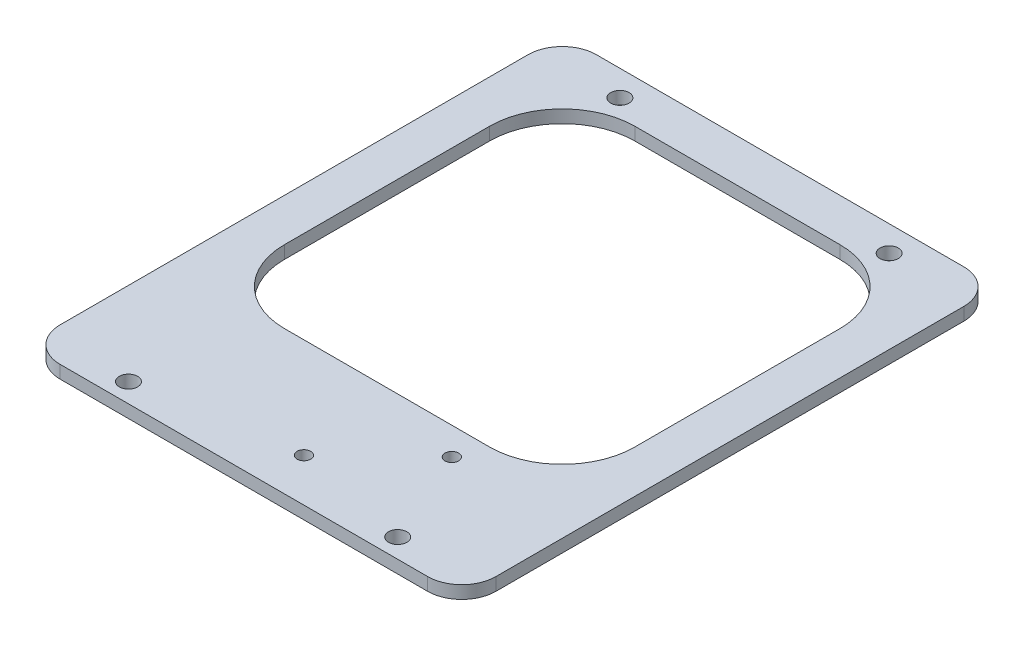
ISO-10303-21;
HEADER;
FILE_DESCRIPTION(('STEP AP214'),'2;1');
FILE_NAME('part.step','',(''),(''),'','','');
FILE_SCHEMA(('AUTOMOTIVE_DESIGN { 1 0 10303 214 1 1 1 1 }'));
ENDSEC;
DATA;
#1=APPLICATION_CONTEXT('core data for automotive mechanical design processes');
#2=APPLICATION_PROTOCOL_DEFINITION('international standard','automotive_design',2000,#1);
#3=PRODUCT_CONTEXT('',#1,'mechanical');
#4=PRODUCT('Part','Part','',(#3));
#5=PRODUCT_RELATED_PRODUCT_CATEGORY('part','',(#4));
#6=PRODUCT_DEFINITION_FORMATION('','',#4);
#7=PRODUCT_DEFINITION_CONTEXT('part definition',#1,'design');
#8=PRODUCT_DEFINITION('design','',#6,#7);
#9=PRODUCT_DEFINITION_SHAPE('','',#8);
#10=(LENGTH_UNIT() NAMED_UNIT(*) SI_UNIT(.MILLI.,.METRE.));
#11=(NAMED_UNIT(*) PLANE_ANGLE_UNIT() SI_UNIT($,.RADIAN.));
#12=(NAMED_UNIT(*) SI_UNIT($,.STERADIAN.) SOLID_ANGLE_UNIT());
#13=UNCERTAINTY_MEASURE_WITH_UNIT(LENGTH_MEASURE(1.E-05),#10,'distance_accuracy_value','');
#14=(GEOMETRIC_REPRESENTATION_CONTEXT(3) GLOBAL_UNCERTAINTY_ASSIGNED_CONTEXT((#13)) GLOBAL_UNIT_ASSIGNED_CONTEXT((#10,
#11,#12)) REPRESENTATION_CONTEXT('',''));
#15=CARTESIAN_POINT('',(0.,0.,0.));
#16=DIRECTION('',(0.,0.,1.));
#17=DIRECTION('',(1.,0.,0.));
#18=AXIS2_PLACEMENT_3D('',#15,#16,#17);
#19=CARTESIAN_POINT('',(-43.,3.,66.5000000000001));
#20=DIRECTION('',(0.,-1.,0.));
#21=DIRECTION('',(0.,0.,-1.));
#22=AXIS2_PLACEMENT_3D('',#19,#20,#21);
#23=PLANE('',#22);
#24=CARTESIAN_POINT('',(21.6128779505783,3.,47.4433965527739));
#25=DIRECTION('',(0.,1.,0.));
#26=DIRECTION('',(0.,0.,1.));
#27=AXIS2_PLACEMENT_3D('',#24,#25,#26);
#28=CIRCLE('',#27,1.6);
#29=CARTESIAN_POINT('',(21.6128779505783,3.,49.0433965527739));
#30=VERTEX_POINT('',#29);
#31=EDGE_CURVE('E415',#30,#30,#28,.T.);
#32=ORIENTED_EDGE('',*,*,#31,.F.);
#33=EDGE_LOOP('',(#32));
#34=FACE_BOUND('',#33,.T.);
#35=CARTESIAN_POINT('',(3.95796000762823,3.,64.391372019705));
#36=DIRECTION('',(0.,1.,0.));
#37=DIRECTION('',(0.,0.,1.));
#38=AXIS2_PLACEMENT_3D('',#35,#36,#37);
#39=CIRCLE('',#38,1.6);
#40=CARTESIAN_POINT('',(3.95796000762823,3.,65.991372019705));
#41=VERTEX_POINT('',#40);
#42=EDGE_CURVE('E420',#41,#41,#39,.T.);
#43=ORIENTED_EDGE('',*,*,#42,.F.);
#44=EDGE_LOOP('',(#43));
#45=FACE_BOUND('',#44,.T.);
#46=DIRECTION('',(0.,0.,-1.));
#47=VECTOR('',#46,1.);
#48=CARTESIAN_POINT('',(41.,3.,24.));
#49=LINE('',#48,#47);
#50=CARTESIAN_POINT('',(41.,3.,24.));
#51=VERTEX_POINT('',#50);
#52=CARTESIAN_POINT('',(41.,3.,-24.));
#53=VERTEX_POINT('',#52);
#54=EDGE_CURVE('E165',#51,#53,#49,.T.);
#55=ORIENTED_EDGE('',*,*,#54,.F.);
#56=CARTESIAN_POINT('',(24.,3.,24.));
#57=DIRECTION('',(0.,1.,0.));
#58=DIRECTION('',(0.,0.,1.));
#59=AXIS2_PLACEMENT_3D('',#56,#57,#58);
#60=CIRCLE('',#59,17.);
#61=CARTESIAN_POINT('',(24.,3.,41.));
#62=VERTEX_POINT('',#61);
#63=EDGE_CURVE('E47',#62,#51,#60,.T.);
#64=ORIENTED_EDGE('',*,*,#63,.F.);
#65=DIRECTION('',(1.,0.,0.));
#66=VECTOR('',#65,1.);
#67=CARTESIAN_POINT('',(-24.,3.,41.));
#68=LINE('',#67,#66);
#69=CARTESIAN_POINT('',(-24.,3.,41.));
#70=VERTEX_POINT('',#69);
#71=EDGE_CURVE('E157',#70,#62,#68,.T.);
#72=ORIENTED_EDGE('',*,*,#71,.F.);
#73=CARTESIAN_POINT('',(-24.,3.,24.));
#74=DIRECTION('',(0.,1.,0.));
#75=DIRECTION('',(0.,0.,-1.));
#76=AXIS2_PLACEMENT_3D('',#73,#74,#75);
#77=CIRCLE('',#76,17.);
#78=CARTESIAN_POINT('',(-41.,3.,24.));
#79=VERTEX_POINT('',#78);
#80=EDGE_CURVE('E184',#79,#70,#77,.T.);
#81=ORIENTED_EDGE('',*,*,#80,.F.);
#82=DIRECTION('',(0.,0.,1.));
#83=VECTOR('',#82,1.);
#84=CARTESIAN_POINT('',(-41.,3.,24.));
#85=LINE('',#84,#83);
#86=CARTESIAN_POINT('',(-41.,3.,-24.));
#87=VERTEX_POINT('',#86);
#88=EDGE_CURVE('E181',#87,#79,#85,.T.);
#89=ORIENTED_EDGE('',*,*,#88,.F.);
#90=CARTESIAN_POINT('',(-24.,3.,-24.));
#91=DIRECTION('',(0.,1.,0.));
#92=DIRECTION('',(0.,0.,-1.));
#93=AXIS2_PLACEMENT_3D('',#90,#91,#92);
#94=CIRCLE('',#93,17.);
#95=CARTESIAN_POINT('',(-24.,3.,-41.));
#96=VERTEX_POINT('',#95);
#97=EDGE_CURVE('E178',#96,#87,#94,.T.);
#98=ORIENTED_EDGE('',*,*,#97,.F.);
#99=DIRECTION('',(-1.,0.,0.));
#100=VECTOR('',#99,1.);
#101=CARTESIAN_POINT('',(-24.,3.,-41.));
#102=LINE('',#101,#100);
#103=CARTESIAN_POINT('',(24.,3.,-41.));
#104=VERTEX_POINT('',#103);
#105=EDGE_CURVE('E175',#104,#96,#102,.T.);
#106=ORIENTED_EDGE('',*,*,#105,.F.);
#107=CARTESIAN_POINT('',(24.,3.,-24.));
#108=DIRECTION('',(0.,1.,0.));
#109=DIRECTION('',(0.,0.,-1.));
#110=AXIS2_PLACEMENT_3D('',#107,#108,#109);
#111=CIRCLE('',#110,17.);
#112=EDGE_CURVE('E172',#53,#104,#111,.T.);
#113=ORIENTED_EDGE('',*,*,#112,.F.);
#114=EDGE_LOOP('',(#55,#64,#72,#81,#89,#98,#106,#113));
#115=FACE_BOUND('',#114,.T.);
#116=CARTESIAN_POINT('',(-43.,3.,66.5000000000001));
#117=DIRECTION('',(0.,1.,0.));
#118=DIRECTION('',(0.,0.,-1.));
#119=AXIS2_PLACEMENT_3D('',#116,#117,#118);
#120=CIRCLE('',#119,8.);
#121=CARTESIAN_POINT('',(-51.,3.,66.5000000000001));
#122=VERTEX_POINT('',#121);
#123=CARTESIAN_POINT('',(-43.,3.,74.5000000000001));
#124=VERTEX_POINT('',#123);
#125=EDGE_CURVE('E225',#122,#124,#120,.T.);
#126=ORIENTED_EDGE('',*,*,#125,.T.);
#127=DIRECTION('',(1.,0.,0.));
#128=VECTOR('',#127,1.);
#129=CARTESIAN_POINT('',(43.,3.,74.5000000000001));
#130=LINE('',#129,#128);
#131=CARTESIAN_POINT('',(43.,3.,74.5000000000001));
#132=VERTEX_POINT('',#131);
#133=EDGE_CURVE('E228',#124,#132,#130,.T.);
#134=ORIENTED_EDGE('',*,*,#133,.T.);
#135=CARTESIAN_POINT('',(43.,3.,66.5000000000001));
#136=DIRECTION('',(0.,1.,0.));
#137=DIRECTION('',(0.,0.,-1.));
#138=AXIS2_PLACEMENT_3D('',#135,#136,#137);
#139=CIRCLE('',#138,8.);
#140=CARTESIAN_POINT('',(51.,3.,66.5000000000001));
#141=VERTEX_POINT('',#140);
#142=EDGE_CURVE('E231',#132,#141,#139,.T.);
#143=ORIENTED_EDGE('',*,*,#142,.T.);
#144=DIRECTION('',(0.,0.,-1.));
#145=VECTOR('',#144,1.);
#146=CARTESIAN_POINT('',(51.,3.,-43.));
#147=LINE('',#146,#145);
#148=CARTESIAN_POINT('',(51.,3.,-43.));
#149=VERTEX_POINT('',#148);
#150=EDGE_CURVE('E233',#141,#149,#147,.T.);
#151=ORIENTED_EDGE('',*,*,#150,.T.);
#152=CARTESIAN_POINT('',(43.,3.,-43.));
#153=DIRECTION('',(0.,1.,0.));
#154=DIRECTION('',(0.,0.,-1.));
#155=AXIS2_PLACEMENT_3D('',#152,#153,#154);
#156=CIRCLE('',#155,8.);
#157=CARTESIAN_POINT('',(43.,3.,-51.));
#158=VERTEX_POINT('',#157);
#159=EDGE_CURVE('E235',#149,#158,#156,.T.);
#160=ORIENTED_EDGE('',*,*,#159,.T.);
#161=DIRECTION('',(-1.,0.,0.));
#162=VECTOR('',#161,1.);
#163=CARTESIAN_POINT('',(-43.,3.,-51.));
#164=LINE('',#163,#162);
#165=CARTESIAN_POINT('',(-43.,3.,-51.));
#166=VERTEX_POINT('',#165);
#167=EDGE_CURVE('E237',#158,#166,#164,.T.);
#168=ORIENTED_EDGE('',*,*,#167,.T.);
#169=CARTESIAN_POINT('',(-43.,3.,-43.));
#170=DIRECTION('',(0.,1.,0.));
#171=DIRECTION('',(0.,0.,1.));
#172=AXIS2_PLACEMENT_3D('',#169,#170,#171);
#173=CIRCLE('',#172,8.);
#174=CARTESIAN_POINT('',(-51.,3.,-43.));
#175=VERTEX_POINT('',#174);
#176=EDGE_CURVE('E239',#166,#175,#173,.T.);
#177=ORIENTED_EDGE('',*,*,#176,.T.);
#178=DIRECTION('',(0.,0.,1.));
#179=VECTOR('',#178,1.);
#180=CARTESIAN_POINT('',(-51.,3.,66.5000000000001));
#181=LINE('',#180,#179);
#182=EDGE_CURVE('E241',#175,#122,#181,.T.);
#183=ORIENTED_EDGE('',*,*,#182,.T.);
#184=EDGE_LOOP('',(#126,#134,#143,#151,#160,#168,#177,#183));
#185=FACE_BOUND('',#184,.T.);
#186=CARTESIAN_POINT('',(-31.5,3.,-45.));
#187=DIRECTION('',(0.,1.,0.));
#188=DIRECTION('',(0.,0.,1.));
#189=AXIS2_PLACEMENT_3D('',#186,#187,#188);
#190=CIRCLE('',#189,2.15);
#191=CARTESIAN_POINT('',(-31.5,3.,-42.85));
#192=VERTEX_POINT('',#191);
#193=EDGE_CURVE('E219',#192,#192,#190,.T.);
#194=ORIENTED_EDGE('',*,*,#193,.F.);
#195=EDGE_LOOP('',(#194));
#196=FACE_BOUND('',#195,.T.);
#197=CARTESIAN_POINT('',(31.5,3.,-45.));
#198=DIRECTION('',(0.,1.,0.));
#199=DIRECTION('',(0.,0.,-1.));
#200=AXIS2_PLACEMENT_3D('',#197,#198,#199);
#201=CIRCLE('',#200,2.15);
#202=CARTESIAN_POINT('',(31.5,3.,-47.15));
#203=VERTEX_POINT('',#202);
#204=EDGE_CURVE('E213',#203,#203,#201,.T.);
#205=ORIENTED_EDGE('',*,*,#204,.F.);
#206=EDGE_LOOP('',(#205));
#207=FACE_BOUND('',#206,.T.);
#208=CARTESIAN_POINT('',(-31.5,3.,70.));
#209=DIRECTION('',(0.,1.,0.));
#210=DIRECTION('',(0.,0.,1.));
#211=AXIS2_PLACEMENT_3D('',#208,#209,#210);
#212=CIRCLE('',#211,2.15);
#213=CARTESIAN_POINT('',(-31.5,3.,72.15));
#214=VERTEX_POINT('',#213);
#215=EDGE_CURVE('E207',#214,#214,#212,.T.);
#216=ORIENTED_EDGE('',*,*,#215,.F.);
#217=EDGE_LOOP('',(#216));
#218=FACE_BOUND('',#217,.T.);
#219=CARTESIAN_POINT('',(31.5,3.,70.));
#220=DIRECTION('',(0.,1.,0.));
#221=DIRECTION('',(0.,0.,-1.));
#222=AXIS2_PLACEMENT_3D('',#219,#220,#221);
#223=CIRCLE('',#222,2.15);
#224=CARTESIAN_POINT('',(31.5,3.,67.85));
#225=VERTEX_POINT('',#224);
#226=EDGE_CURVE('E201',#225,#225,#223,.T.);
#227=ORIENTED_EDGE('',*,*,#226,.F.);
#228=EDGE_LOOP('',(#227));
#229=FACE_BOUND('',#228,.T.);
#230=ADVANCED_FACE('F32',(#34,#45,#115,#185,#196,#207,#218,#229),#23,.F.);
#231=CARTESIAN_POINT('',(-43.,0.,66.5000000000001));
#232=DIRECTION('',(0.,-1.,0.));
#233=DIRECTION('',(0.,0.,-1.));
#234=AXIS2_PLACEMENT_3D('',#231,#232,#233);
#235=PLANE('',#234);
#236=CARTESIAN_POINT('',(21.6128779505783,0.,47.4433965527739));
#237=DIRECTION('',(0.,-1.,0.));
#238=DIRECTION('',(0.,0.,-1.));
#239=AXIS2_PLACEMENT_3D('',#236,#237,#238);
#240=CIRCLE('',#239,1.6);
#241=CARTESIAN_POINT('',(21.6128779505783,0.,45.8433965527739));
#242=VERTEX_POINT('',#241);
#243=EDGE_CURVE('E413',#242,#242,#240,.F.);
#244=ORIENTED_EDGE('',*,*,#243,.T.);
#245=EDGE_LOOP('',(#244));
#246=FACE_BOUND('',#245,.T.);
#247=CARTESIAN_POINT('',(3.95796000762823,0.,64.391372019705));
#248=DIRECTION('',(0.,-1.,0.));
#249=DIRECTION('',(0.,0.,-1.));
#250=AXIS2_PLACEMENT_3D('',#247,#248,#249);
#251=CIRCLE('',#250,1.6);
#252=CARTESIAN_POINT('',(3.95796000762823,0.,62.791372019705));
#253=VERTEX_POINT('',#252);
#254=EDGE_CURVE('E425',#253,#253,#251,.F.);
#255=ORIENTED_EDGE('',*,*,#254,.T.);
#256=EDGE_LOOP('',(#255));
#257=FACE_BOUND('',#256,.T.);
#258=CARTESIAN_POINT('',(24.,0.,24.));
#259=DIRECTION('',(0.,-1.,0.));
#260=DIRECTION('',(0.,0.,-1.));
#261=AXIS2_PLACEMENT_3D('',#258,#259,#260);
#262=CIRCLE('',#261,17.);
#263=CARTESIAN_POINT('',(24.,0.,41.));
#264=VERTEX_POINT('',#263);
#265=CARTESIAN_POINT('',(41.,0.,24.));
#266=VERTEX_POINT('',#265);
#267=EDGE_CURVE('E155',#264,#266,#262,.F.);
#268=ORIENTED_EDGE('',*,*,#267,.T.);
#269=DIRECTION('',(0.,0.,-1.));
#270=VECTOR('',#269,1.);
#271=CARTESIAN_POINT('',(41.,0.,24.));
#272=LINE('',#271,#270);
#273=CARTESIAN_POINT('',(41.,0.,-24.));
#274=VERTEX_POINT('',#273);
#275=EDGE_CURVE('E144',#266,#274,#272,.T.);
#276=ORIENTED_EDGE('',*,*,#275,.T.);
#277=CARTESIAN_POINT('',(24.,0.,-24.));
#278=DIRECTION('',(0.,-1.,0.));
#279=DIRECTION('',(0.,0.,-1.));
#280=AXIS2_PLACEMENT_3D('',#277,#278,#279);
#281=CIRCLE('',#280,17.);
#282=CARTESIAN_POINT('',(24.,0.,-41.));
#283=VERTEX_POINT('',#282);
#284=EDGE_CURVE('E416',#274,#283,#281,.F.);
#285=ORIENTED_EDGE('',*,*,#284,.T.);
#286=DIRECTION('',(-1.,0.,0.));
#287=VECTOR('',#286,1.);
#288=CARTESIAN_POINT('',(-24.,0.,-41.));
#289=LINE('',#288,#287);
#290=CARTESIAN_POINT('',(-24.,0.,-41.));
#291=VERTEX_POINT('',#290);
#292=EDGE_CURVE('E418',#283,#291,#289,.T.);
#293=ORIENTED_EDGE('',*,*,#292,.T.);
#294=CARTESIAN_POINT('',(-24.,0.,-24.));
#295=DIRECTION('',(0.,-1.,0.));
#296=DIRECTION('',(0.,0.,-1.));
#297=AXIS2_PLACEMENT_3D('',#294,#295,#296);
#298=CIRCLE('',#297,17.);
#299=CARTESIAN_POINT('',(-41.,0.,-24.));
#300=VERTEX_POINT('',#299);
#301=EDGE_CURVE('E430',#291,#300,#298,.F.);
#302=ORIENTED_EDGE('',*,*,#301,.T.);
#303=DIRECTION('',(0.,0.,1.));
#304=VECTOR('',#303,1.);
#305=CARTESIAN_POINT('',(-41.,0.,24.));
#306=LINE('',#305,#304);
#307=CARTESIAN_POINT('',(-41.,0.,24.));
#308=VERTEX_POINT('',#307);
#309=EDGE_CURVE('E433',#300,#308,#306,.T.);
#310=ORIENTED_EDGE('',*,*,#309,.T.);
#311=CARTESIAN_POINT('',(-24.,0.,24.));
#312=DIRECTION('',(0.,-1.,0.));
#313=DIRECTION('',(0.,0.,-1.));
#314=AXIS2_PLACEMENT_3D('',#311,#312,#313);
#315=CIRCLE('',#314,17.);
#316=CARTESIAN_POINT('',(-24.,0.,41.));
#317=VERTEX_POINT('',#316);
#318=EDGE_CURVE('E167',#308,#317,#315,.F.);
#319=ORIENTED_EDGE('',*,*,#318,.T.);
#320=DIRECTION('',(1.,0.,0.));
#321=VECTOR('',#320,1.);
#322=CARTESIAN_POINT('',(-24.,0.,41.));
#323=LINE('',#322,#321);
#324=EDGE_CURVE('E163',#317,#264,#323,.T.);
#325=ORIENTED_EDGE('',*,*,#324,.T.);
#326=EDGE_LOOP('',(#268,#276,#285,#293,#302,#310,#319,#325));
#327=FACE_BOUND('',#326,.T.);
#328=CARTESIAN_POINT('',(-31.5,0.,70.));
#329=DIRECTION('',(0.,1.,0.));
#330=DIRECTION('',(0.,0.,1.));
#331=AXIS2_PLACEMENT_3D('',#328,#329,#330);
#332=CIRCLE('',#331,2.15);
#333=CARTESIAN_POINT('',(-31.5,0.,72.15));
#334=VERTEX_POINT('',#333);
#335=EDGE_CURVE('E204',#334,#334,#332,.T.);
#336=ORIENTED_EDGE('',*,*,#335,.T.);
#337=EDGE_LOOP('',(#336));
#338=FACE_BOUND('',#337,.T.);
#339=CARTESIAN_POINT('',(-31.5,0.,-45.));
#340=DIRECTION('',(0.,1.,0.));
#341=DIRECTION('',(0.,0.,1.));
#342=AXIS2_PLACEMENT_3D('',#339,#340,#341);
#343=CIRCLE('',#342,2.15);
#344=CARTESIAN_POINT('',(-31.5,0.,-42.85));
#345=VERTEX_POINT('',#344);
#346=EDGE_CURVE('E216',#345,#345,#343,.T.);
#347=ORIENTED_EDGE('',*,*,#346,.T.);
#348=EDGE_LOOP('',(#347));
#349=FACE_BOUND('',#348,.T.);
#350=CARTESIAN_POINT('',(-43.,0.,66.5000000000001));
#351=DIRECTION('',(0.,1.,0.));
#352=DIRECTION('',(0.,0.,-1.));
#353=AXIS2_PLACEMENT_3D('',#350,#351,#352);
#354=CIRCLE('',#353,8.);
#355=CARTESIAN_POINT('',(-51.,0.,66.5000000000001));
#356=VERTEX_POINT('',#355);
#357=CARTESIAN_POINT('',(-43.,0.,74.5000000000001));
#358=VERTEX_POINT('',#357);
#359=EDGE_CURVE('E222',#356,#358,#354,.T.);
#360=ORIENTED_EDGE('',*,*,#359,.F.);
#361=DIRECTION('',(0.,0.,1.));
#362=VECTOR('',#361,1.);
#363=CARTESIAN_POINT('',(-51.,0.,66.5000000000001));
#364=LINE('',#363,#362);
#365=CARTESIAN_POINT('',(-51.,0.,-43.));
#366=VERTEX_POINT('',#365);
#367=EDGE_CURVE('E229',#366,#356,#364,.T.);
#368=ORIENTED_EDGE('',*,*,#367,.F.);
#369=CARTESIAN_POINT('',(-43.,0.,-43.));
#370=DIRECTION('',(0.,1.,0.));
#371=DIRECTION('',(0.,0.,1.));
#372=AXIS2_PLACEMENT_3D('',#369,#370,#371);
#373=CIRCLE('',#372,8.);
#374=CARTESIAN_POINT('',(-43.,0.,-51.));
#375=VERTEX_POINT('',#374);
#376=EDGE_CURVE('E256',#375,#366,#373,.T.);
#377=ORIENTED_EDGE('',*,*,#376,.F.);
#378=DIRECTION('',(-1.,0.,0.));
#379=VECTOR('',#378,1.);
#380=CARTESIAN_POINT('',(-43.,0.,-51.));
#381=LINE('',#380,#379);
#382=CARTESIAN_POINT('',(43.,0.,-51.));
#383=VERTEX_POINT('',#382);
#384=EDGE_CURVE('E254',#383,#375,#381,.T.);
#385=ORIENTED_EDGE('',*,*,#384,.F.);
#386=CARTESIAN_POINT('',(43.,0.,-43.));
#387=DIRECTION('',(0.,1.,0.));
#388=DIRECTION('',(0.,0.,-1.));
#389=AXIS2_PLACEMENT_3D('',#386,#387,#388);
#390=CIRCLE('',#389,8.);
#391=CARTESIAN_POINT('',(51.,0.,-43.));
#392=VERTEX_POINT('',#391);
#393=EDGE_CURVE('E252',#392,#383,#390,.T.);
#394=ORIENTED_EDGE('',*,*,#393,.F.);
#395=DIRECTION('',(0.,0.,-1.));
#396=VECTOR('',#395,1.);
#397=CARTESIAN_POINT('',(51.,0.,-43.));
#398=LINE('',#397,#396);
#399=CARTESIAN_POINT('',(51.,0.,66.5000000000001));
#400=VERTEX_POINT('',#399);
#401=EDGE_CURVE('E250',#400,#392,#398,.T.);
#402=ORIENTED_EDGE('',*,*,#401,.F.);
#403=CARTESIAN_POINT('',(43.,0.,66.5000000000001));
#404=DIRECTION('',(0.,1.,0.));
#405=DIRECTION('',(0.,0.,-1.));
#406=AXIS2_PLACEMENT_3D('',#403,#404,#405);
#407=CIRCLE('',#406,8.);
#408=CARTESIAN_POINT('',(43.,0.,74.5000000000001));
#409=VERTEX_POINT('',#408);
#410=EDGE_CURVE('E248',#409,#400,#407,.T.);
#411=ORIENTED_EDGE('',*,*,#410,.F.);
#412=DIRECTION('',(1.,0.,0.));
#413=VECTOR('',#412,1.);
#414=CARTESIAN_POINT('',(43.,0.,74.5000000000001));
#415=LINE('',#414,#413);
#416=EDGE_CURVE('E246',#358,#409,#415,.T.);
#417=ORIENTED_EDGE('',*,*,#416,.F.);
#418=EDGE_LOOP('',(#360,#368,#377,#385,#394,#402,#411,#417));
#419=FACE_BOUND('',#418,.T.);
#420=CARTESIAN_POINT('',(31.5,0.,-45.));
#421=DIRECTION('',(0.,1.,0.));
#422=DIRECTION('',(0.,0.,-1.));
#423=AXIS2_PLACEMENT_3D('',#420,#421,#422);
#424=CIRCLE('',#423,2.15);
#425=CARTESIAN_POINT('',(31.5,0.,-47.15));
#426=VERTEX_POINT('',#425);
#427=EDGE_CURVE('E210',#426,#426,#424,.T.);
#428=ORIENTED_EDGE('',*,*,#427,.T.);
#429=EDGE_LOOP('',(#428));
#430=FACE_BOUND('',#429,.T.);
#431=CARTESIAN_POINT('',(31.5,0.,70.));
#432=DIRECTION('',(0.,1.,0.));
#433=DIRECTION('',(0.,0.,-1.));
#434=AXIS2_PLACEMENT_3D('',#431,#432,#433);
#435=CIRCLE('',#434,2.15);
#436=CARTESIAN_POINT('',(31.5,0.,67.85));
#437=VERTEX_POINT('',#436);
#438=EDGE_CURVE('E151',#437,#437,#435,.T.);
#439=ORIENTED_EDGE('',*,*,#438,.T.);
#440=EDGE_LOOP('',(#439));
#441=FACE_BOUND('',#440,.T.);
#442=ADVANCED_FACE('F160',(#246,#257,#327,#338,#349,#419,#430,#441),#235,.T.);
#443=CARTESIAN_POINT('',(-43.,3.,66.5000000000001));
#444=DIRECTION('',(0.,-1.,0.));
#445=DIRECTION('',(0.,0.,-1.));
#446=AXIS2_PLACEMENT_3D('',#443,#444,#445);
#447=CYLINDRICAL_SURFACE('',#446,8.);
#448=ORIENTED_EDGE('',*,*,#359,.T.);
#449=DIRECTION('',(0.,-1.,0.));
#450=VECTOR('',#449,1.);
#451=CARTESIAN_POINT('',(-43.,3.,74.5000000000001));
#452=LINE('',#451,#450);
#453=EDGE_CURVE('E11',#124,#358,#452,.T.);
#454=ORIENTED_EDGE('',*,*,#453,.F.);
#455=ORIENTED_EDGE('',*,*,#125,.F.);
#456=DIRECTION('',(0.,-1.,0.));
#457=VECTOR('',#456,1.);
#458=CARTESIAN_POINT('',(-51.,3.,66.5000000000001));
#459=LINE('',#458,#457);
#460=EDGE_CURVE('E243',#122,#356,#459,.T.);
#461=ORIENTED_EDGE('',*,*,#460,.T.);
#462=EDGE_LOOP('',(#448,#454,#455,#461));
#463=FACE_BOUND('',#462,.T.);
#464=ADVANCED_FACE('F34',(#463),#447,.T.);
#465=CARTESIAN_POINT('',(43.,3.,74.5000000000001));
#466=DIRECTION('',(0.,0.,-1.));
#467=DIRECTION('',(-1.,0.,0.));
#468=AXIS2_PLACEMENT_3D('',#465,#466,#467);
#469=PLANE('',#468);
#470=ORIENTED_EDGE('',*,*,#416,.T.);
#471=DIRECTION('',(0.,-1.,0.));
#472=VECTOR('',#471,1.);
#473=CARTESIAN_POINT('',(43.,3.,74.5000000000001));
#474=LINE('',#473,#472);
#475=EDGE_CURVE('E40',#132,#409,#474,.T.);
#476=ORIENTED_EDGE('',*,*,#475,.F.);
#477=ORIENTED_EDGE('',*,*,#133,.F.);
#478=ORIENTED_EDGE('',*,*,#453,.T.);
#479=EDGE_LOOP('',(#470,#476,#477,#478));
#480=FACE_BOUND('',#479,.T.);
#481=ADVANCED_FACE('F303',(#480),#469,.F.);
#482=CARTESIAN_POINT('',(43.,3.,66.5000000000001));
#483=DIRECTION('',(0.,-1.,0.));
#484=DIRECTION('',(0.,0.,-1.));
#485=AXIS2_PLACEMENT_3D('',#482,#483,#484);
#486=CYLINDRICAL_SURFACE('',#485,8.);
#487=ORIENTED_EDGE('',*,*,#410,.T.);
#488=DIRECTION('',(0.,-1.,0.));
#489=VECTOR('',#488,1.);
#490=CARTESIAN_POINT('',(51.,3.,66.5000000000001));
#491=LINE('',#490,#489);
#492=EDGE_CURVE('E273',#141,#400,#491,.T.);
#493=ORIENTED_EDGE('',*,*,#492,.F.);
#494=ORIENTED_EDGE('',*,*,#142,.F.);
#495=ORIENTED_EDGE('',*,*,#475,.T.);
#496=EDGE_LOOP('',(#487,#493,#494,#495));
#497=FACE_BOUND('',#496,.T.);
#498=ADVANCED_FACE('F280',(#497),#486,.T.);
#499=CARTESIAN_POINT('',(51.,3.,-43.));
#500=DIRECTION('',(-1.,0.,0.));
#501=DIRECTION('',(0.,0.,1.));
#502=AXIS2_PLACEMENT_3D('',#499,#500,#501);
#503=PLANE('',#502);
#504=ORIENTED_EDGE('',*,*,#401,.T.);
#505=DIRECTION('',(0.,-1.,0.));
#506=VECTOR('',#505,1.);
#507=CARTESIAN_POINT('',(51.,3.,-43.));
#508=LINE('',#507,#506);
#509=EDGE_CURVE('E270',#149,#392,#508,.T.);
#510=ORIENTED_EDGE('',*,*,#509,.F.);
#511=ORIENTED_EDGE('',*,*,#150,.F.);
#512=ORIENTED_EDGE('',*,*,#492,.T.);
#513=EDGE_LOOP('',(#504,#510,#511,#512));
#514=FACE_BOUND('',#513,.T.);
#515=ADVANCED_FACE('F291',(#514),#503,.F.);
#516=CARTESIAN_POINT('',(43.,3.,-43.));
#517=DIRECTION('',(0.,-1.,0.));
#518=DIRECTION('',(0.,0.,-1.));
#519=AXIS2_PLACEMENT_3D('',#516,#517,#518);
#520=CYLINDRICAL_SURFACE('',#519,8.);
#521=ORIENTED_EDGE('',*,*,#393,.T.);
#522=DIRECTION('',(0.,-1.,0.));
#523=VECTOR('',#522,1.);
#524=CARTESIAN_POINT('',(43.,3.,-51.));
#525=LINE('',#524,#523);
#526=EDGE_CURVE('E267',#158,#383,#525,.T.);
#527=ORIENTED_EDGE('',*,*,#526,.F.);
#528=ORIENTED_EDGE('',*,*,#159,.F.);
#529=ORIENTED_EDGE('',*,*,#509,.T.);
#530=EDGE_LOOP('',(#521,#527,#528,#529));
#531=FACE_BOUND('',#530,.T.);
#532=ADVANCED_FACE('F295',(#531),#520,.T.);
#533=CARTESIAN_POINT('',(-43.,3.,-51.));
#534=DIRECTION('',(0.,0.,1.));
#535=DIRECTION('',(1.,0.,0.));
#536=AXIS2_PLACEMENT_3D('',#533,#534,#535);
#537=PLANE('',#536);
#538=ORIENTED_EDGE('',*,*,#384,.T.);
#539=DIRECTION('',(0.,-1.,0.));
#540=VECTOR('',#539,1.);
#541=CARTESIAN_POINT('',(-43.,3.,-51.));
#542=LINE('',#541,#540);
#543=EDGE_CURVE('E264',#166,#375,#542,.T.);
#544=ORIENTED_EDGE('',*,*,#543,.F.);
#545=ORIENTED_EDGE('',*,*,#167,.F.);
#546=ORIENTED_EDGE('',*,*,#526,.T.);
#547=EDGE_LOOP('',(#538,#544,#545,#546));
#548=FACE_BOUND('',#547,.T.);
#549=ADVANCED_FACE('F316',(#548),#537,.F.);
#550=CARTESIAN_POINT('',(-43.,3.,-43.));
#551=DIRECTION('',(0.,-1.,0.));
#552=DIRECTION('',(0.,0.,-1.));
#553=AXIS2_PLACEMENT_3D('',#550,#551,#552);
#554=CYLINDRICAL_SURFACE('',#553,8.);
#555=ORIENTED_EDGE('',*,*,#376,.T.);
#556=DIRECTION('',(0.,-1.,0.));
#557=VECTOR('',#556,1.);
#558=CARTESIAN_POINT('',(-51.,3.,-43.));
#559=LINE('',#558,#557);
#560=EDGE_CURVE('E261',#175,#366,#559,.T.);
#561=ORIENTED_EDGE('',*,*,#560,.F.);
#562=ORIENTED_EDGE('',*,*,#176,.F.);
#563=ORIENTED_EDGE('',*,*,#543,.T.);
#564=EDGE_LOOP('',(#555,#561,#562,#563));
#565=FACE_BOUND('',#564,.T.);
#566=ADVANCED_FACE('F314',(#565),#554,.T.);
#567=CARTESIAN_POINT('',(-51.,3.,66.5000000000001));
#568=DIRECTION('',(1.,0.,0.));
#569=DIRECTION('',(0.,0.,-1.));
#570=AXIS2_PLACEMENT_3D('',#567,#568,#569);
#571=PLANE('',#570);
#572=ORIENTED_EDGE('',*,*,#367,.T.);
#573=ORIENTED_EDGE('',*,*,#460,.F.);
#574=ORIENTED_EDGE('',*,*,#182,.F.);
#575=ORIENTED_EDGE('',*,*,#560,.T.);
#576=EDGE_LOOP('',(#572,#573,#574,#575));
#577=FACE_BOUND('',#576,.T.);
#578=ADVANCED_FACE('F309',(#577),#571,.F.);
#579=CARTESIAN_POINT('',(-31.5,3.,-45.));
#580=DIRECTION('',(0.,-1.,0.));
#581=DIRECTION('',(0.,0.,-1.));
#582=AXIS2_PLACEMENT_3D('',#579,#580,#581);
#583=CYLINDRICAL_SURFACE('',#582,2.15);
#584=ORIENTED_EDGE('',*,*,#193,.T.);
#585=EDGE_LOOP('',(#584));
#586=FACE_BOUND('',#585,.T.);
#587=ORIENTED_EDGE('',*,*,#346,.F.);
#588=EDGE_LOOP('',(#587));
#589=FACE_BOUND('',#588,.T.);
#590=ADVANCED_FACE('F336',(#586,#589),#583,.F.);
#591=CARTESIAN_POINT('',(31.5,3.,-45.));
#592=DIRECTION('',(0.,-1.,0.));
#593=DIRECTION('',(0.,0.,-1.));
#594=AXIS2_PLACEMENT_3D('',#591,#592,#593);
#595=CYLINDRICAL_SURFACE('',#594,2.15);
#596=ORIENTED_EDGE('',*,*,#204,.T.);
#597=EDGE_LOOP('',(#596));
#598=FACE_BOUND('',#597,.T.);
#599=ORIENTED_EDGE('',*,*,#427,.F.);
#600=EDGE_LOOP('',(#599));
#601=FACE_BOUND('',#600,.T.);
#602=ADVANCED_FACE('F343',(#598,#601),#595,.F.);
#603=CARTESIAN_POINT('',(-31.5,3.,70.));
#604=DIRECTION('',(0.,-1.,0.));
#605=DIRECTION('',(0.,0.,-1.));
#606=AXIS2_PLACEMENT_3D('',#603,#604,#605);
#607=CYLINDRICAL_SURFACE('',#606,2.15);
#608=ORIENTED_EDGE('',*,*,#215,.T.);
#609=EDGE_LOOP('',(#608));
#610=FACE_BOUND('',#609,.T.);
#611=ORIENTED_EDGE('',*,*,#335,.F.);
#612=EDGE_LOOP('',(#611));
#613=FACE_BOUND('',#612,.T.);
#614=ADVANCED_FACE('F348',(#610,#613),#607,.F.);
#615=CARTESIAN_POINT('',(31.5,3.,70.));
#616=DIRECTION('',(0.,-1.,0.));
#617=DIRECTION('',(0.,0.,-1.));
#618=AXIS2_PLACEMENT_3D('',#615,#616,#617);
#619=CYLINDRICAL_SURFACE('',#618,2.15);
#620=ORIENTED_EDGE('',*,*,#226,.T.);
#621=EDGE_LOOP('',(#620));
#622=FACE_BOUND('',#621,.T.);
#623=ORIENTED_EDGE('',*,*,#438,.F.);
#624=EDGE_LOOP('',(#623));
#625=FACE_BOUND('',#624,.T.);
#626=ADVANCED_FACE('F361',(#622,#625),#619,.F.);
#627=CARTESIAN_POINT('',(24.,-0.00100000000000013,24.));
#628=DIRECTION('',(0.,1.,0.));
#629=DIRECTION('',(0.,0.,1.));
#630=AXIS2_PLACEMENT_3D('',#627,#628,#629);
#631=CYLINDRICAL_SURFACE('',#630,17.);
#632=DIRECTION('',(0.,1.,0.));
#633=VECTOR('',#632,1.);
#634=CARTESIAN_POINT('',(24.,-0.00100000000000013,41.));
#635=LINE('',#634,#633);
#636=EDGE_CURVE('E152',#264,#62,#635,.T.);
#637=ORIENTED_EDGE('',*,*,#636,.T.);
#638=ORIENTED_EDGE('',*,*,#63,.T.);
#639=DIRECTION('',(0.,1.,0.));
#640=VECTOR('',#639,1.);
#641=CARTESIAN_POINT('',(41.,-0.00100000000000013,24.));
#642=LINE('',#641,#640);
#643=EDGE_CURVE('E146',#266,#51,#642,.T.);
#644=ORIENTED_EDGE('',*,*,#643,.F.);
#645=ORIENTED_EDGE('',*,*,#267,.F.);
#646=EDGE_LOOP('',(#637,#638,#644,#645));
#647=FACE_BOUND('',#646,.T.);
#648=ADVANCED_FACE('F154',(#647),#631,.F.);
#649=CARTESIAN_POINT('',(-24.,-0.00100000000000013,41.));
#650=DIRECTION('',(0.,0.,1.));
#651=DIRECTION('',(1.,0.,0.));
#652=AXIS2_PLACEMENT_3D('',#649,#650,#651);
#653=PLANE('',#652);
#654=DIRECTION('',(0.,1.,0.));
#655=VECTOR('',#654,1.);
#656=CARTESIAN_POINT('',(-24.,-0.00100000000000013,41.));
#657=LINE('',#656,#655);
#658=EDGE_CURVE('E190',#317,#70,#657,.T.);
#659=ORIENTED_EDGE('',*,*,#658,.T.);
#660=ORIENTED_EDGE('',*,*,#71,.T.);
#661=ORIENTED_EDGE('',*,*,#636,.F.);
#662=ORIENTED_EDGE('',*,*,#324,.F.);
#663=EDGE_LOOP('',(#659,#660,#661,#662));
#664=FACE_BOUND('',#663,.T.);
#665=ADVANCED_FACE('F371',(#664),#653,.F.);
#666=CARTESIAN_POINT('',(-24.,-0.00100000000000013,24.));
#667=DIRECTION('',(0.,1.,0.));
#668=DIRECTION('',(0.,0.,1.));
#669=AXIS2_PLACEMENT_3D('',#666,#667,#668);
#670=CYLINDRICAL_SURFACE('',#669,17.);
#671=DIRECTION('',(0.,1.,0.));
#672=VECTOR('',#671,1.);
#673=CARTESIAN_POINT('',(-41.,-0.00100000000000013,24.));
#674=LINE('',#673,#672);
#675=EDGE_CURVE('E192',#308,#79,#674,.T.);
#676=ORIENTED_EDGE('',*,*,#675,.T.);
#677=ORIENTED_EDGE('',*,*,#80,.T.);
#678=ORIENTED_EDGE('',*,*,#658,.F.);
#679=ORIENTED_EDGE('',*,*,#318,.F.);
#680=EDGE_LOOP('',(#676,#677,#678,#679));
#681=FACE_BOUND('',#680,.T.);
#682=ADVANCED_FACE('F394',(#681),#670,.F.);
#683=CARTESIAN_POINT('',(-41.,-0.00100000000000013,24.));
#684=DIRECTION('',(-1.,0.,0.));
#685=DIRECTION('',(0.,0.,1.));
#686=AXIS2_PLACEMENT_3D('',#683,#684,#685);
#687=PLANE('',#686);
#688=DIRECTION('',(0.,1.,0.));
#689=VECTOR('',#688,1.);
#690=CARTESIAN_POINT('',(-41.,-0.00100000000000013,-24.));
#691=LINE('',#690,#689);
#692=EDGE_CURVE('E194',#300,#87,#691,.T.);
#693=ORIENTED_EDGE('',*,*,#692,.T.);
#694=ORIENTED_EDGE('',*,*,#88,.T.);
#695=ORIENTED_EDGE('',*,*,#675,.F.);
#696=ORIENTED_EDGE('',*,*,#309,.F.);
#697=EDGE_LOOP('',(#693,#694,#695,#696));
#698=FACE_BOUND('',#697,.T.);
#699=ADVANCED_FACE('F390',(#698),#687,.F.);
#700=CARTESIAN_POINT('',(-24.,-0.00100000000000013,-24.));
#701=DIRECTION('',(0.,1.,0.));
#702=DIRECTION('',(0.,0.,1.));
#703=AXIS2_PLACEMENT_3D('',#700,#701,#702);
#704=CYLINDRICAL_SURFACE('',#703,17.);
#705=DIRECTION('',(0.,1.,0.));
#706=VECTOR('',#705,1.);
#707=CARTESIAN_POINT('',(-24.,-0.00100000000000013,-41.));
#708=LINE('',#707,#706);
#709=EDGE_CURVE('E196',#291,#96,#708,.T.);
#710=ORIENTED_EDGE('',*,*,#709,.T.);
#711=ORIENTED_EDGE('',*,*,#97,.T.);
#712=ORIENTED_EDGE('',*,*,#692,.F.);
#713=ORIENTED_EDGE('',*,*,#301,.F.);
#714=EDGE_LOOP('',(#710,#711,#712,#713));
#715=FACE_BOUND('',#714,.T.);
#716=ADVANCED_FACE('F386',(#715),#704,.F.);
#717=CARTESIAN_POINT('',(-24.,-0.00100000000000013,-41.));
#718=DIRECTION('',(0.,0.,-1.));
#719=DIRECTION('',(-1.,0.,0.));
#720=AXIS2_PLACEMENT_3D('',#717,#718,#719);
#721=PLANE('',#720);
#722=DIRECTION('',(0.,1.,0.));
#723=VECTOR('',#722,1.);
#724=CARTESIAN_POINT('',(24.,-0.00100000000000013,-41.));
#725=LINE('',#724,#723);
#726=EDGE_CURVE('E198',#283,#104,#725,.T.);
#727=ORIENTED_EDGE('',*,*,#726,.T.);
#728=ORIENTED_EDGE('',*,*,#105,.T.);
#729=ORIENTED_EDGE('',*,*,#709,.F.);
#730=ORIENTED_EDGE('',*,*,#292,.F.);
#731=EDGE_LOOP('',(#727,#728,#729,#730));
#732=FACE_BOUND('',#731,.T.);
#733=ADVANCED_FACE('F382',(#732),#721,.F.);
#734=CARTESIAN_POINT('',(24.,-0.00100000000000013,-24.));
#735=DIRECTION('',(0.,1.,0.));
#736=DIRECTION('',(0.,0.,1.));
#737=AXIS2_PLACEMENT_3D('',#734,#735,#736);
#738=CYLINDRICAL_SURFACE('',#737,17.);
#739=DIRECTION('',(0.,1.,0.));
#740=VECTOR('',#739,1.);
#741=CARTESIAN_POINT('',(41.,-0.00100000000000013,-24.));
#742=LINE('',#741,#740);
#743=EDGE_CURVE('E55',#274,#53,#742,.T.);
#744=ORIENTED_EDGE('',*,*,#743,.T.);
#745=ORIENTED_EDGE('',*,*,#112,.T.);
#746=ORIENTED_EDGE('',*,*,#726,.F.);
#747=ORIENTED_EDGE('',*,*,#284,.F.);
#748=EDGE_LOOP('',(#744,#745,#746,#747));
#749=FACE_BOUND('',#748,.T.);
#750=ADVANCED_FACE('F379',(#749),#738,.F.);
#751=CARTESIAN_POINT('',(41.,-0.00100000000000013,24.));
#752=DIRECTION('',(1.,0.,0.));
#753=DIRECTION('',(0.,0.,-1.));
#754=AXIS2_PLACEMENT_3D('',#751,#752,#753);
#755=PLANE('',#754);
#756=ORIENTED_EDGE('',*,*,#643,.T.);
#757=ORIENTED_EDGE('',*,*,#54,.T.);
#758=ORIENTED_EDGE('',*,*,#743,.F.);
#759=ORIENTED_EDGE('',*,*,#275,.F.);
#760=EDGE_LOOP('',(#756,#757,#758,#759));
#761=FACE_BOUND('',#760,.T.);
#762=ADVANCED_FACE('F145',(#761),#755,.F.);
#763=CARTESIAN_POINT('',(3.95796000762823,-0.00100000000000013,64.391372019705));
#764=DIRECTION('',(0.,1.,0.));
#765=DIRECTION('',(0.,0.,1.));
#766=AXIS2_PLACEMENT_3D('',#763,#764,#765);
#767=CYLINDRICAL_SURFACE('',#766,1.6);
#768=ORIENTED_EDGE('',*,*,#254,.F.);
#769=EDGE_LOOP('',(#768));
#770=FACE_BOUND('',#769,.T.);
#771=ORIENTED_EDGE('',*,*,#42,.T.);
#772=EDGE_LOOP('',(#771));
#773=FACE_BOUND('',#772,.T.);
#774=ADVANCED_FACE('F378',(#770,#773),#767,.F.);
#775=CARTESIAN_POINT('',(21.6128779505783,-0.00100000000000013,47.4433965527739));
#776=DIRECTION('',(0.,1.,0.));
#777=DIRECTION('',(0.,0.,1.));
#778=AXIS2_PLACEMENT_3D('',#775,#776,#777);
#779=CYLINDRICAL_SURFACE('',#778,1.6);
#780=ORIENTED_EDGE('',*,*,#243,.F.);
#781=EDGE_LOOP('',(#780));
#782=FACE_BOUND('',#781,.T.);
#783=ORIENTED_EDGE('',*,*,#31,.T.);
#784=EDGE_LOOP('',(#783));
#785=FACE_BOUND('',#784,.T.);
#786=ADVANCED_FACE('F404',(#782,#785),#779,.F.);
#787=CLOSED_SHELL('',(#230,#442,#464,#481,#498,#515,#532,#549,#566,#578,#590,#602,#614,#626,
#648,#665,#682,#699,#716,#733,#750,#762,#774,#786));
#788=MANIFOLD_SOLID_BREP('B2',#787);
#789=ADVANCED_BREP_SHAPE_REPRESENTATION('',(#18,#788),#14);
#790=SHAPE_DEFINITION_REPRESENTATION(#9,#789);
ENDSEC;
END-ISO-10303-21;
